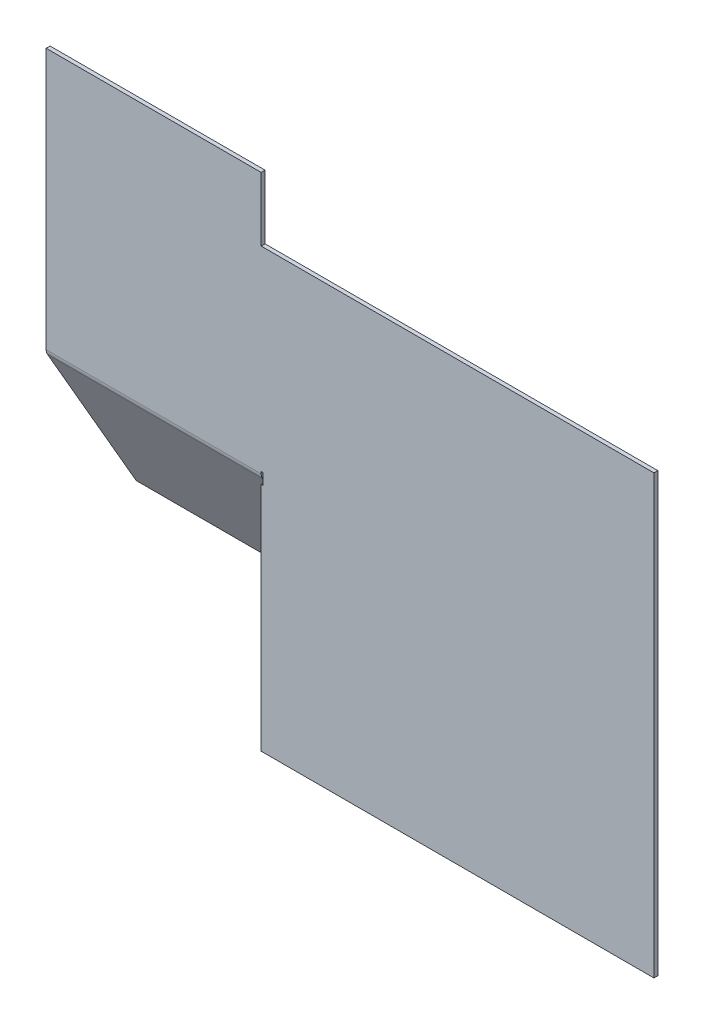
ISO-10303-21;
HEADER;
FILE_DESCRIPTION(('STEP AP214'),'2;1');
FILE_NAME('part.step','',(''),(''),'','','');
FILE_SCHEMA(('AUTOMOTIVE_DESIGN { 1 0 10303 214 1 1 1 1 }'));
ENDSEC;
DATA;
#1=APPLICATION_CONTEXT('core data for automotive mechanical design processes');
#2=APPLICATION_PROTOCOL_DEFINITION('international standard','automotive_design',2000,#1);
#3=PRODUCT_CONTEXT('',#1,'mechanical');
#4=PRODUCT('Part','Part','',(#3));
#5=PRODUCT_RELATED_PRODUCT_CATEGORY('part','',(#4));
#6=PRODUCT_DEFINITION_FORMATION('','',#4);
#7=PRODUCT_DEFINITION_CONTEXT('part definition',#1,'design');
#8=PRODUCT_DEFINITION('design','',#6,#7);
#9=PRODUCT_DEFINITION_SHAPE('','',#8);
#10=(LENGTH_UNIT() NAMED_UNIT(*) SI_UNIT(.MILLI.,.METRE.));
#11=(NAMED_UNIT(*) PLANE_ANGLE_UNIT() SI_UNIT($,.RADIAN.));
#12=(NAMED_UNIT(*) SI_UNIT($,.STERADIAN.) SOLID_ANGLE_UNIT());
#13=UNCERTAINTY_MEASURE_WITH_UNIT(LENGTH_MEASURE(1.E-05),#10,'distance_accuracy_value','');
#14=(GEOMETRIC_REPRESENTATION_CONTEXT(3) GLOBAL_UNCERTAINTY_ASSIGNED_CONTEXT((#13)) GLOBAL_UNIT_ASSIGNED_CONTEXT((#10,
#11,#12)) REPRESENTATION_CONTEXT('',''));
#15=CARTESIAN_POINT('',(0.,0.,0.));
#16=DIRECTION('',(0.,0.,1.));
#17=DIRECTION('',(1.,0.,0.));
#18=AXIS2_PLACEMENT_3D('',#15,#16,#17);
#19=CARTESIAN_POINT('',(-158.715779703997,93.9806866952789,-1.51892));
#20=DIRECTION('',(-1.,0.,0.));
#21=DIRECTION('',(0.,0.,1.));
#22=AXIS2_PLACEMENT_3D('',#19,#20,#21);
#23=PLANE('',#22);
#24=DIRECTION('',(0.,-1.,0.));
#25=VECTOR('',#24,1.);
#26=CARTESIAN_POINT('',(-158.715779703997,93.9806866952789,-1.51892));
#27=LINE('',#26,#25);
#28=CARTESIAN_POINT('',(-158.715779703997,93.9806866952789,-1.51892));
#29=VERTEX_POINT('',#28);
#30=CARTESIAN_POINT('',(-158.715779703997,-7.47103009313973,-1.51892));
#31=VERTEX_POINT('',#30);
#32=EDGE_CURVE('E169',#29,#31,#27,.T.);
#33=ORIENTED_EDGE('',*,*,#32,.T.);
#34=DIRECTION('',(0.,0.,1.));
#35=VECTOR('',#34,1.);
#36=CARTESIAN_POINT('',(-158.715779703997,-7.47103009313973,-1.51892));
#37=LINE('',#36,#35);
#38=CARTESIAN_POINT('',(-158.715779703997,-7.47103009313973,0.));
#39=VERTEX_POINT('',#38);
#40=EDGE_CURVE('E258',#31,#39,#37,.T.);
#41=ORIENTED_EDGE('',*,*,#40,.T.);
#42=DIRECTION('',(0.,-1.,0.));
#43=VECTOR('',#42,1.);
#44=CARTESIAN_POINT('',(-158.715779703997,93.9806866952789,0.));
#45=LINE('',#44,#43);
#46=CARTESIAN_POINT('',(-158.715779703997,93.9806866952789,0.));
#47=VERTEX_POINT('',#46);
#48=EDGE_CURVE('E150',#47,#39,#45,.T.);
#49=ORIENTED_EDGE('',*,*,#48,.F.);
#50=DIRECTION('',(0.,0.,1.));
#51=VECTOR('',#50,1.);
#52=CARTESIAN_POINT('',(-158.715779703997,93.9806866952789,-1.51892));
#53=LINE('',#52,#51);
#54=EDGE_CURVE('E71',#29,#47,#53,.T.);
#55=ORIENTED_EDGE('',*,*,#54,.F.);
#56=EDGE_LOOP('',(#33,#41,#49,#55));
#57=FACE_BOUND('',#56,.T.);
#58=ADVANCED_FACE('F55',(#57),#23,.T.);
#59=CARTESIAN_POINT('',(0.,0.,-1.51892));
#60=DIRECTION('',(0.,0.,1.));
#61=DIRECTION('',(1.,0.,0.));
#62=AXIS2_PLACEMENT_3D('',#59,#60,#61);
#63=PLANE('',#62);
#64=DIRECTION('',(-1.,0.,0.));
#65=VECTOR('',#64,1.);
#66=CARTESIAN_POINT('',(-158.715779703997,-7.47103009313973,-1.51892));
#67=LINE('',#66,#65);
#68=CARTESIAN_POINT('',(-75.1624597214999,-7.47103009313973,-1.51892));
#69=VERTEX_POINT('',#68);
#70=EDGE_CURVE('E263',#31,#69,#67,.F.);
#71=ORIENTED_EDGE('',*,*,#70,.F.);
#72=ORIENTED_EDGE('',*,*,#32,.F.);
#73=DIRECTION('',(-1.,0.,0.));
#74=VECTOR('',#73,1.);
#75=CARTESIAN_POINT('',(-158.715779703997,93.9806866952789,-1.51892));
#76=LINE('',#75,#74);
#77=CARTESIAN_POINT('',(-75.1624597214999,93.9806866952789,-1.51892));
#78=VERTEX_POINT('',#77);
#79=EDGE_CURVE('E138',#78,#29,#76,.T.);
#80=ORIENTED_EDGE('',*,*,#79,.F.);
#81=DIRECTION('',(0.,1.,0.));
#82=VECTOR('',#81,1.);
#83=CARTESIAN_POINT('',(-75.1624597214999,93.9806866952789,-1.51892));
#84=LINE('',#83,#82);
#85=CARTESIAN_POINT('',(-75.1624597214999,69.1855268970568,-1.51892));
#86=VERTEX_POINT('',#85);
#87=EDGE_CURVE('E123',#86,#78,#84,.T.);
#88=ORIENTED_EDGE('',*,*,#87,.F.);
#89=DIRECTION('',(-1.,0.,0.));
#90=VECTOR('',#89,1.);
#91=CARTESIAN_POINT('',(-75.1624597214999,69.1855268970568,-1.51892));
#92=LINE('',#91,#90);
#93=CARTESIAN_POINT('',(77.4785037258567,69.1855268970568,-1.51892));
#94=VERTEX_POINT('',#93);
#95=EDGE_CURVE('E137',#94,#86,#92,.T.);
#96=ORIENTED_EDGE('',*,*,#95,.F.);
#97=DIRECTION('',(0.,1.,0.));
#98=VECTOR('',#97,1.);
#99=CARTESIAN_POINT('',(77.4785037258567,-100.814473102943,-1.51892));
#100=LINE('',#99,#98);
#101=CARTESIAN_POINT('',(77.4785037258567,-100.814473102943,-1.51892));
#102=VERTEX_POINT('',#101);
#103=EDGE_CURVE('E142',#102,#94,#100,.T.);
#104=ORIENTED_EDGE('',*,*,#103,.F.);
#105=DIRECTION('',(1.,0.,0.));
#106=VECTOR('',#105,1.);
#107=CARTESIAN_POINT('',(-75.1624597214999,-100.814473102943,-1.51892));
#108=LINE('',#107,#106);
#109=CARTESIAN_POINT('',(-75.1624597214999,-100.814473102943,-1.51892));
#110=VERTEX_POINT('',#109);
#111=EDGE_CURVE('E144',#110,#102,#108,.T.);
#112=ORIENTED_EDGE('',*,*,#111,.F.);
#113=DIRECTION('',(0.,-1.,0.));
#114=VECTOR('',#113,1.);
#115=CARTESIAN_POINT('',(-75.1624597214999,-11.019313304721,-1.51892));
#116=LINE('',#115,#114);
#117=CARTESIAN_POINT('',(-75.1624597214999,-11.019313304721,-1.51892));
#118=VERTEX_POINT('',#117);
#119=EDGE_CURVE('E220',#118,#110,#116,.T.);
#120=ORIENTED_EDGE('',*,*,#119,.F.);
#121=DIRECTION('',(-1.,0.,0.));
#122=VECTOR('',#121,1.);
#123=CARTESIAN_POINT('',(-74.4029997214999,-11.019313304721,-1.51892));
#124=LINE('',#123,#122);
#125=CARTESIAN_POINT('',(-74.4029997214999,-11.019313304721,-1.51892));
#126=VERTEX_POINT('',#125);
#127=EDGE_CURVE('E238',#126,#118,#124,.T.);
#128=ORIENTED_EDGE('',*,*,#127,.F.);
#129=DIRECTION('',(0.,-1.,0.));
#130=VECTOR('',#129,1.);
#131=CARTESIAN_POINT('',(-74.4029997214999,-6.71157009313973,-1.51892));
#132=LINE('',#131,#130);
#133=CARTESIAN_POINT('',(-74.4029997214999,-6.71157009313973,-1.51892));
#134=VERTEX_POINT('',#133);
#135=EDGE_CURVE('E211',#134,#126,#132,.T.);
#136=ORIENTED_EDGE('',*,*,#135,.F.);
#137=DIRECTION('',(1.,0.,0.));
#138=VECTOR('',#137,1.);
#139=CARTESIAN_POINT('',(-75.1624597214999,-6.71157009313973,-1.51892));
#140=LINE('',#139,#138);
#141=CARTESIAN_POINT('',(-75.1624597214999,-6.71157009313973,-1.51892));
#142=VERTEX_POINT('',#141);
#143=EDGE_CURVE('E210',#142,#134,#140,.T.);
#144=ORIENTED_EDGE('',*,*,#143,.F.);
#145=DIRECTION('',(0.,1.,0.));
#146=VECTOR('',#145,1.);
#147=CARTESIAN_POINT('',(-75.1624597214999,-7.47103009313973,-1.51892));
#148=LINE('',#147,#146);
#149=EDGE_CURVE('E154',#69,#142,#148,.T.);
#150=ORIENTED_EDGE('',*,*,#149,.F.);
#151=EDGE_LOOP('',(#71,#72,#80,#88,#96,#104,#112,#120,#128,#136,#144,#150));
#152=FACE_BOUND('',#151,.T.);
#153=ADVANCED_FACE('F135',(#152),#63,.F.);
#154=CARTESIAN_POINT('',(0.,0.,0.));
#155=DIRECTION('',(0.,0.,1.));
#156=DIRECTION('',(1.,0.,0.));
#157=AXIS2_PLACEMENT_3D('',#154,#155,#156);
#158=PLANE('',#157);
#159=ORIENTED_EDGE('',*,*,#48,.T.);
#160=DIRECTION('',(-1.,0.,0.));
#161=VECTOR('',#160,1.);
#162=CARTESIAN_POINT('',(-158.715779703997,-7.47103009313973,0.));
#163=LINE('',#162,#161);
#164=CARTESIAN_POINT('',(-75.1624597214999,-7.47103009313973,0.));
#165=VERTEX_POINT('',#164);
#166=EDGE_CURVE('E266',#39,#165,#163,.F.);
#167=ORIENTED_EDGE('',*,*,#166,.T.);
#168=DIRECTION('',(0.,1.,0.));
#169=VECTOR('',#168,1.);
#170=CARTESIAN_POINT('',(-75.1624597214999,0.,0.));
#171=LINE('',#170,#169);
#172=CARTESIAN_POINT('',(-75.1624597214999,-6.71157009313973,0.));
#173=VERTEX_POINT('',#172);
#174=EDGE_CURVE('E13',#165,#173,#171,.T.);
#175=ORIENTED_EDGE('',*,*,#174,.T.);
#176=DIRECTION('',(1.,0.,0.));
#177=VECTOR('',#176,1.);
#178=CARTESIAN_POINT('',(0.,-6.71157009313973,0.));
#179=LINE('',#178,#177);
#180=CARTESIAN_POINT('',(-74.4029997214999,-6.71157009313973,0.));
#181=VERTEX_POINT('',#180);
#182=EDGE_CURVE('E63',#173,#181,#179,.T.);
#183=ORIENTED_EDGE('',*,*,#182,.T.);
#184=DIRECTION('',(0.,-1.,0.));
#185=VECTOR('',#184,1.);
#186=CARTESIAN_POINT('',(-74.4029997214999,0.,0.));
#187=LINE('',#186,#185);
#188=CARTESIAN_POINT('',(-74.4029997214999,-11.019313304721,0.));
#189=VERTEX_POINT('',#188);
#190=EDGE_CURVE('E181',#181,#189,#187,.T.);
#191=ORIENTED_EDGE('',*,*,#190,.T.);
#192=DIRECTION('',(-1.,0.,0.));
#193=VECTOR('',#192,1.);
#194=CARTESIAN_POINT('',(0.,-11.0193133047209,0.));
#195=LINE('',#194,#193);
#196=CARTESIAN_POINT('',(-75.1624597214999,-11.019313304721,0.));
#197=VERTEX_POINT('',#196);
#198=EDGE_CURVE('E171',#189,#197,#195,.T.);
#199=ORIENTED_EDGE('',*,*,#198,.T.);
#200=DIRECTION('',(0.,-1.,0.));
#201=VECTOR('',#200,1.);
#202=CARTESIAN_POINT('',(-75.1624597214999,-11.019313304721,0.));
#203=LINE('',#202,#201);
#204=CARTESIAN_POINT('',(-75.1624597214999,-100.814473102943,0.));
#205=VERTEX_POINT('',#204);
#206=EDGE_CURVE('E153',#197,#205,#203,.T.);
#207=ORIENTED_EDGE('',*,*,#206,.T.);
#208=DIRECTION('',(1.,0.,0.));
#209=VECTOR('',#208,1.);
#210=CARTESIAN_POINT('',(-75.1624597214999,-100.814473102943,0.));
#211=LINE('',#210,#209);
#212=CARTESIAN_POINT('',(77.4785037258567,-100.814473102943,0.));
#213=VERTEX_POINT('',#212);
#214=EDGE_CURVE('E157',#205,#213,#211,.T.);
#215=ORIENTED_EDGE('',*,*,#214,.T.);
#216=DIRECTION('',(0.,1.,0.));
#217=VECTOR('',#216,1.);
#218=CARTESIAN_POINT('',(77.4785037258567,69.1855268970568,0.));
#219=LINE('',#218,#217);
#220=CARTESIAN_POINT('',(77.4785037258567,69.1855268970568,0.));
#221=VERTEX_POINT('',#220);
#222=EDGE_CURVE('E160',#213,#221,#219,.T.);
#223=ORIENTED_EDGE('',*,*,#222,.T.);
#224=DIRECTION('',(-1.,0.,0.));
#225=VECTOR('',#224,1.);
#226=CARTESIAN_POINT('',(-75.1624597214999,69.1855268970568,0.));
#227=LINE('',#226,#225);
#228=CARTESIAN_POINT('',(-75.1624597214999,69.1855268970568,0.));
#229=VERTEX_POINT('',#228);
#230=EDGE_CURVE('E163',#221,#229,#227,.T.);
#231=ORIENTED_EDGE('',*,*,#230,.T.);
#232=DIRECTION('',(0.,1.,0.));
#233=VECTOR('',#232,1.);
#234=CARTESIAN_POINT('',(-75.1624597214999,93.9806866952789,0.));
#235=LINE('',#234,#233);
#236=CARTESIAN_POINT('',(-75.1624597214999,93.9806866952789,0.));
#237=VERTEX_POINT('',#236);
#238=EDGE_CURVE('E125',#229,#237,#235,.T.);
#239=ORIENTED_EDGE('',*,*,#238,.T.);
#240=DIRECTION('',(-1.,0.,0.));
#241=VECTOR('',#240,1.);
#242=CARTESIAN_POINT('',(-158.715779703997,93.9806866952789,0.));
#243=LINE('',#242,#241);
#244=EDGE_CURVE('E166',#237,#47,#243,.T.);
#245=ORIENTED_EDGE('',*,*,#244,.T.);
#246=EDGE_LOOP('',(#159,#167,#175,#183,#191,#199,#207,#215,#223,#231,#239,#245));
#247=FACE_BOUND('',#246,.T.);
#248=ADVANCED_FACE('F187',(#247),#158,.T.);
#249=CARTESIAN_POINT('',(-158.715779703997,93.9806866952789,-1.51892));
#250=DIRECTION('',(0.,1.,0.));
#251=DIRECTION('',(0.,0.,1.));
#252=AXIS2_PLACEMENT_3D('',#249,#250,#251);
#253=PLANE('',#252);
#254=ORIENTED_EDGE('',*,*,#244,.F.);
#255=DIRECTION('',(0.,0.,1.));
#256=VECTOR('',#255,1.);
#257=CARTESIAN_POINT('',(-75.1624597214999,93.9806866952789,-1.51892));
#258=LINE('',#257,#256);
#259=EDGE_CURVE('E98',#78,#237,#258,.T.);
#260=ORIENTED_EDGE('',*,*,#259,.F.);
#261=ORIENTED_EDGE('',*,*,#79,.T.);
#262=ORIENTED_EDGE('',*,*,#54,.T.);
#263=EDGE_LOOP('',(#254,#260,#261,#262));
#264=FACE_BOUND('',#263,.T.);
#265=ADVANCED_FACE('F264',(#264),#253,.T.);
#266=CARTESIAN_POINT('',(-75.1624597214999,93.9806866952789,-1.51892));
#267=DIRECTION('',(1.,0.,0.));
#268=DIRECTION('',(0.,0.,-1.));
#269=AXIS2_PLACEMENT_3D('',#266,#267,#268);
#270=PLANE('',#269);
#271=ORIENTED_EDGE('',*,*,#238,.F.);
#272=DIRECTION('',(0.,0.,1.));
#273=VECTOR('',#272,1.);
#274=CARTESIAN_POINT('',(-75.1624597214999,69.1855268970568,-1.51892));
#275=LINE('',#274,#273);
#276=EDGE_CURVE('E120',#86,#229,#275,.T.);
#277=ORIENTED_EDGE('',*,*,#276,.F.);
#278=ORIENTED_EDGE('',*,*,#87,.T.);
#279=ORIENTED_EDGE('',*,*,#259,.T.);
#280=EDGE_LOOP('',(#271,#277,#278,#279));
#281=FACE_BOUND('',#280,.T.);
#282=ADVANCED_FACE('F122',(#281),#270,.T.);
#283=CARTESIAN_POINT('',(-75.1624597214999,69.1855268970568,-1.51892));
#284=DIRECTION('',(0.,1.,0.));
#285=DIRECTION('',(0.,0.,1.));
#286=AXIS2_PLACEMENT_3D('',#283,#284,#285);
#287=PLANE('',#286);
#288=ORIENTED_EDGE('',*,*,#230,.F.);
#289=DIRECTION('',(0.,0.,1.));
#290=VECTOR('',#289,1.);
#291=CARTESIAN_POINT('',(77.4785037258567,69.1855268970568,-1.51892));
#292=LINE('',#291,#290);
#293=EDGE_CURVE('E130',#94,#221,#292,.T.);
#294=ORIENTED_EDGE('',*,*,#293,.F.);
#295=ORIENTED_EDGE('',*,*,#95,.T.);
#296=ORIENTED_EDGE('',*,*,#276,.T.);
#297=EDGE_LOOP('',(#288,#294,#295,#296));
#298=FACE_BOUND('',#297,.T.);
#299=ADVANCED_FACE('F141',(#298),#287,.T.);
#300=CARTESIAN_POINT('',(77.4785037258567,69.1855268970568,-1.51892));
#301=DIRECTION('',(1.,0.,0.));
#302=DIRECTION('',(0.,0.,-1.));
#303=AXIS2_PLACEMENT_3D('',#300,#301,#302);
#304=PLANE('',#303);
#305=ORIENTED_EDGE('',*,*,#222,.F.);
#306=DIRECTION('',(0.,0.,1.));
#307=VECTOR('',#306,1.);
#308=CARTESIAN_POINT('',(77.4785037258567,-100.814473102943,-1.51892));
#309=LINE('',#308,#307);
#310=EDGE_CURVE('E174',#102,#213,#309,.T.);
#311=ORIENTED_EDGE('',*,*,#310,.F.);
#312=ORIENTED_EDGE('',*,*,#103,.T.);
#313=ORIENTED_EDGE('',*,*,#293,.T.);
#314=EDGE_LOOP('',(#305,#311,#312,#313));
#315=FACE_BOUND('',#314,.T.);
#316=ADVANCED_FACE('F240',(#315),#304,.T.);
#317=CARTESIAN_POINT('',(-75.1624597214999,-100.814473102943,-1.51892));
#318=DIRECTION('',(0.,-1.,0.));
#319=DIRECTION('',(0.,0.,-1.));
#320=AXIS2_PLACEMENT_3D('',#317,#318,#319);
#321=PLANE('',#320);
#322=ORIENTED_EDGE('',*,*,#214,.F.);
#323=DIRECTION('',(0.,0.,1.));
#324=VECTOR('',#323,1.);
#325=CARTESIAN_POINT('',(-75.1624597214999,-100.814473102943,-1.51892));
#326=LINE('',#325,#324);
#327=EDGE_CURVE('E110',#110,#205,#326,.T.);
#328=ORIENTED_EDGE('',*,*,#327,.F.);
#329=ORIENTED_EDGE('',*,*,#111,.T.);
#330=ORIENTED_EDGE('',*,*,#310,.T.);
#331=EDGE_LOOP('',(#322,#328,#329,#330));
#332=FACE_BOUND('',#331,.T.);
#333=ADVANCED_FACE('F222',(#332),#321,.T.);
#334=CARTESIAN_POINT('',(-75.1624597214999,-11.019313304721,-1.51892));
#335=DIRECTION('',(-1.,0.,0.));
#336=DIRECTION('',(0.,-1.,0.));
#337=AXIS2_PLACEMENT_3D('',#334,#335,#336);
#338=PLANE('',#337);
#339=ORIENTED_EDGE('',*,*,#206,.F.);
#340=DIRECTION('',(0.,0.,1.));
#341=VECTOR('',#340,1.);
#342=CARTESIAN_POINT('',(-75.1624597214999,-11.019313304721,-1.51892));
#343=LINE('',#342,#341);
#344=EDGE_CURVE('E149',#118,#197,#343,.T.);
#345=ORIENTED_EDGE('',*,*,#344,.F.);
#346=ORIENTED_EDGE('',*,*,#119,.T.);
#347=ORIENTED_EDGE('',*,*,#327,.T.);
#348=EDGE_LOOP('',(#339,#345,#346,#347));
#349=FACE_BOUND('',#348,.T.);
#350=ADVANCED_FACE('F229',(#349),#338,.T.);
#351=CARTESIAN_POINT('',(-75.1624597214999,-7.47103009313973,-1.51892));
#352=DIRECTION('',(1.,0.,0.));
#353=DIRECTION('',(0.,0.,-1.));
#354=AXIS2_PLACEMENT_3D('',#351,#352,#353);
#355=PLANE('',#354);
#356=ORIENTED_EDGE('',*,*,#174,.F.);
#357=DIRECTION('',(0.,0.,1.));
#358=VECTOR('',#357,1.);
#359=CARTESIAN_POINT('',(-75.1624597214999,-7.47103009313973,-1.51892));
#360=LINE('',#359,#358);
#361=EDGE_CURVE('E290',#69,#165,#360,.T.);
#362=ORIENTED_EDGE('',*,*,#361,.F.);
#363=ORIENTED_EDGE('',*,*,#149,.T.);
#364=DIRECTION('',(0.,0.,1.));
#365=VECTOR('',#364,1.);
#366=CARTESIAN_POINT('',(-75.1624597214999,-6.71157009313973,-1.51892));
#367=LINE('',#366,#365);
#368=EDGE_CURVE('E201',#142,#173,#367,.T.);
#369=ORIENTED_EDGE('',*,*,#368,.T.);
#370=EDGE_LOOP('',(#356,#362,#363,#369));
#371=FACE_BOUND('',#370,.T.);
#372=ADVANCED_FACE('F206',(#371),#355,.T.);
#373=CARTESIAN_POINT('',(-75.1624597214999,-6.71157009313973,-1.51892));
#374=DIRECTION('',(0.,-1.,0.));
#375=DIRECTION('',(0.,0.,-1.));
#376=AXIS2_PLACEMENT_3D('',#373,#374,#375);
#377=PLANE('',#376);
#378=ORIENTED_EDGE('',*,*,#182,.F.);
#379=ORIENTED_EDGE('',*,*,#368,.F.);
#380=ORIENTED_EDGE('',*,*,#143,.T.);
#381=DIRECTION('',(0.,0.,1.));
#382=VECTOR('',#381,1.);
#383=CARTESIAN_POINT('',(-74.4029997214999,-6.71157009313973,-1.51892));
#384=LINE('',#383,#382);
#385=EDGE_CURVE('E204',#134,#181,#384,.T.);
#386=ORIENTED_EDGE('',*,*,#385,.T.);
#387=EDGE_LOOP('',(#378,#379,#380,#386));
#388=FACE_BOUND('',#387,.T.);
#389=ADVANCED_FACE('F198',(#388),#377,.T.);
#390=CARTESIAN_POINT('',(-74.4029997214999,-6.71157009313973,-1.51892));
#391=DIRECTION('',(-1.,0.,0.));
#392=DIRECTION('',(0.,0.,1.));
#393=AXIS2_PLACEMENT_3D('',#390,#391,#392);
#394=PLANE('',#393);
#395=ORIENTED_EDGE('',*,*,#190,.F.);
#396=ORIENTED_EDGE('',*,*,#385,.F.);
#397=ORIENTED_EDGE('',*,*,#135,.T.);
#398=DIRECTION('',(0.,0.,1.));
#399=VECTOR('',#398,1.);
#400=CARTESIAN_POINT('',(-74.4029997214999,-11.019313304721,-1.51892));
#401=LINE('',#400,#399);
#402=EDGE_CURVE('E288',#126,#189,#401,.T.);
#403=ORIENTED_EDGE('',*,*,#402,.T.);
#404=EDGE_LOOP('',(#395,#396,#397,#403));
#405=FACE_BOUND('',#404,.T.);
#406=ADVANCED_FACE('F292',(#405),#394,.T.);
#407=CARTESIAN_POINT('',(-74.4029997214999,-11.019313304721,-1.51892));
#408=DIRECTION('',(0.,1.,0.));
#409=DIRECTION('',(-1.,0.,0.));
#410=AXIS2_PLACEMENT_3D('',#407,#408,#409);
#411=PLANE('',#410);
#412=ORIENTED_EDGE('',*,*,#198,.F.);
#413=ORIENTED_EDGE('',*,*,#402,.F.);
#414=ORIENTED_EDGE('',*,*,#127,.T.);
#415=ORIENTED_EDGE('',*,*,#344,.T.);
#416=EDGE_LOOP('',(#412,#413,#414,#415));
#417=FACE_BOUND('',#416,.T.);
#418=ADVANCED_FACE('F235',(#417),#411,.T.);
#419=CARTESIAN_POINT('',(-75.1624597214999,-7.47103009313973,-3.42392));
#420=DIRECTION('',(1.,0.,0.));
#421=DIRECTION('',(0.,0.,-1.));
#422=AXIS2_PLACEMENT_3D('',#419,#420,#421);
#423=PLANE('',#422);
#424=DIRECTION('',(0.,-0.499999999999995,0.866025403784442));
#425=VECTOR('',#424,1.);
#426=CARTESIAN_POINT('',(-75.1624597214999,-9.18299009313971,-0.458718299474373));
#427=LINE('',#426,#425);
#428=CARTESIAN_POINT('',(-75.1624597214999,-8.42353009313972,-1.77414160579064));
#429=VERTEX_POINT('',#428);
#430=CARTESIAN_POINT('',(-75.1624597214999,-9.18299009313972,-0.458718299474374));
#431=VERTEX_POINT('',#430);
#432=EDGE_CURVE('E313',#429,#431,#427,.T.);
#433=ORIENTED_EDGE('',*,*,#432,.F.);
#434=CARTESIAN_POINT('',(-75.1624597214999,-7.47103009313973,-3.42392));
#435=DIRECTION('',(-1.,0.,0.));
#436=DIRECTION('',(0.,0.,1.));
#437=AXIS2_PLACEMENT_3D('',#434,#435,#436);
#438=CIRCLE('',#437,1.905);
#439=EDGE_CURVE('E305',#69,#429,#438,.F.);
#440=ORIENTED_EDGE('',*,*,#439,.F.);
#441=ORIENTED_EDGE('',*,*,#361,.T.);
#442=CARTESIAN_POINT('',(-75.1624597214999,-7.47103009313973,-3.42392));
#443=DIRECTION('',(-1.,0.,0.));
#444=DIRECTION('',(0.,0.,1.));
#445=AXIS2_PLACEMENT_3D('',#442,#443,#444);
#446=CIRCLE('',#445,3.42392);
#447=EDGE_CURVE('E297',#165,#431,#446,.F.);
#448=ORIENTED_EDGE('',*,*,#447,.T.);
#449=EDGE_LOOP('',(#433,#440,#441,#448));
#450=FACE_BOUND('',#449,.T.);
#451=ADVANCED_FACE('F375',(#450),#423,.T.);
#452=CARTESIAN_POINT('',(-158.715779703997,-7.47103009313973,-3.42392));
#453=DIRECTION('',(1.,0.,0.));
#454=DIRECTION('',(0.,0.,-1.));
#455=AXIS2_PLACEMENT_3D('',#452,#453,#454);
#456=PLANE('',#455);
#457=CARTESIAN_POINT('',(-158.715779703997,-7.47103009313973,-3.42392));
#458=DIRECTION('',(-1.,0.,0.));
#459=DIRECTION('',(0.,0.,1.));
#460=AXIS2_PLACEMENT_3D('',#457,#458,#459);
#461=CIRCLE('',#460,1.905);
#462=CARTESIAN_POINT('',(-158.715779703997,-8.42353009313972,-1.77414160579064));
#463=VERTEX_POINT('',#462);
#464=EDGE_CURVE('E300',#463,#31,#461,.T.);
#465=ORIENTED_EDGE('',*,*,#464,.F.);
#466=DIRECTION('',(0.,-0.499999999999995,0.866025403784442));
#467=VECTOR('',#466,1.);
#468=CARTESIAN_POINT('',(-158.715779703997,-8.42353009313972,-1.77414160579064));
#469=LINE('',#468,#467);
#470=CARTESIAN_POINT('',(-158.715779703997,-9.18299009313972,-0.458718299474374));
#471=VERTEX_POINT('',#470);
#472=EDGE_CURVE('E318',#463,#471,#469,.T.);
#473=ORIENTED_EDGE('',*,*,#472,.T.);
#474=CARTESIAN_POINT('',(-158.715779703997,-7.47103009313973,-3.42392));
#475=DIRECTION('',(-1.,0.,0.));
#476=DIRECTION('',(0.,0.,1.));
#477=AXIS2_PLACEMENT_3D('',#474,#475,#476);
#478=CIRCLE('',#477,3.42392);
#479=EDGE_CURVE('E308',#471,#39,#478,.T.);
#480=ORIENTED_EDGE('',*,*,#479,.T.);
#481=ORIENTED_EDGE('',*,*,#40,.F.);
#482=EDGE_LOOP('',(#465,#473,#480,#481));
#483=FACE_BOUND('',#482,.T.);
#484=ADVANCED_FACE('F368',(#483),#456,.F.);
#485=CARTESIAN_POINT('',(-158.715779703997,-7.47103009313973,-3.42392));
#486=DIRECTION('',(-1.,0.,0.));
#487=DIRECTION('',(0.,-0.499999999999995,0.866025403784442));
#488=AXIS2_PLACEMENT_3D('',#485,#486,#487);
#489=CYLINDRICAL_SURFACE('',#488,3.42392);
#490=ORIENTED_EDGE('',*,*,#166,.F.);
#491=ORIENTED_EDGE('',*,*,#479,.F.);
#492=DIRECTION('',(-1.,0.,0.));
#493=VECTOR('',#492,1.);
#494=CARTESIAN_POINT('',(0.,-9.18299009313972,-0.458718299474374));
#495=LINE('',#494,#493);
#496=EDGE_CURVE('E321',#431,#471,#495,.T.);
#497=ORIENTED_EDGE('',*,*,#496,.F.);
#498=ORIENTED_EDGE('',*,*,#447,.F.);
#499=EDGE_LOOP('',(#490,#491,#497,#498));
#500=FACE_BOUND('',#499,.T.);
#501=ADVANCED_FACE('F373',(#500),#489,.T.);
#502=CARTESIAN_POINT('',(-158.715779703997,-7.47103009313973,-3.42392));
#503=DIRECTION('',(-1.,0.,0.));
#504=DIRECTION('',(0.,-0.499999999999995,0.866025403784442));
#505=AXIS2_PLACEMENT_3D('',#502,#503,#504);
#506=CYLINDRICAL_SURFACE('',#505,1.905);
#507=ORIENTED_EDGE('',*,*,#70,.T.);
#508=ORIENTED_EDGE('',*,*,#439,.T.);
#509=DIRECTION('',(1.,0.,0.));
#510=VECTOR('',#509,1.);
#511=CARTESIAN_POINT('',(-75.1624597214999,-8.42353009313972,-1.77414160579064));
#512=LINE('',#511,#510);
#513=EDGE_CURVE('E316',#429,#463,#512,.F.);
#514=ORIENTED_EDGE('',*,*,#513,.T.);
#515=ORIENTED_EDGE('',*,*,#464,.T.);
#516=EDGE_LOOP('',(#507,#508,#514,#515));
#517=FACE_BOUND('',#516,.T.);
#518=ADVANCED_FACE('F388',(#517),#506,.F.);
#519=CARTESIAN_POINT('',(-158.715779703997,-8.74093330472101,-0.203496693683736));
#520=DIRECTION('',(-1.,0.,0.));
#521=DIRECTION('',(0.,0.,1.));
#522=AXIS2_PLACEMENT_3D('',#519,#520,#521);
#523=PLANE('',#522);
#524=DIRECTION('',(0.,0.866025403784442,0.499999999999995));
#525=VECTOR('',#524,1.);
#526=CARTESIAN_POINT('',(-158.715779703997,-8.74093330472101,-0.203496693683735));
#527=LINE('',#526,#525);
#528=CARTESIAN_POINT('',(-158.715779703997,-69.0102449569994,-34.9999999999996));
#529=VERTEX_POINT('',#528);
#530=EDGE_CURVE('E339',#529,#471,#527,.T.);
#531=ORIENTED_EDGE('',*,*,#530,.T.);
#532=ORIENTED_EDGE('',*,*,#472,.F.);
#533=DIRECTION('',(0.,-0.866025403784442,-0.499999999999995));
#534=VECTOR('',#533,1.);
#535=CARTESIAN_POINT('',(-158.715779703997,0.94072332697795,3.6323126270741));
#536=LINE('',#535,#534);
#537=CARTESIAN_POINT('',(-158.715779703997,-68.2507849569994,-36.3154233063159));
#538=VERTEX_POINT('',#537);
#539=EDGE_CURVE('E330',#538,#463,#536,.F.);
#540=ORIENTED_EDGE('',*,*,#539,.F.);
#541=DIRECTION('',(0.,0.499999999999995,-0.866025403784442));
#542=VECTOR('',#541,1.);
#543=CARTESIAN_POINT('',(-158.715779703997,-69.0102449569994,-34.9999999999996));
#544=LINE('',#543,#542);
#545=EDGE_CURVE('E303',#529,#538,#544,.T.);
#546=ORIENTED_EDGE('',*,*,#545,.F.);
#547=EDGE_LOOP('',(#531,#532,#540,#546));
#548=FACE_BOUND('',#547,.T.);
#549=ADVANCED_FACE('F365',(#548),#523,.T.);
#550=CARTESIAN_POINT('',(-75.1624597214999,-69.0102449569994,-34.9999999999996));
#551=DIRECTION('',(1.,0.,0.));
#552=DIRECTION('',(0.,1.,0.));
#553=AXIS2_PLACEMENT_3D('',#550,#551,#552);
#554=PLANE('',#553);
#555=DIRECTION('',(0.,0.866025403784442,0.499999999999995));
#556=VECTOR('',#555,1.);
#557=CARTESIAN_POINT('',(-75.1624597214999,0.940723326977963,3.63231262707411));
#558=LINE('',#557,#556);
#559=CARTESIAN_POINT('',(-75.1624597214999,-68.2507849569994,-36.3154233063159));
#560=VERTEX_POINT('',#559);
#561=EDGE_CURVE('E324',#429,#560,#558,.F.);
#562=ORIENTED_EDGE('',*,*,#561,.F.);
#563=ORIENTED_EDGE('',*,*,#432,.T.);
#564=DIRECTION('',(0.,-0.866025403784442,-0.499999999999995));
#565=VECTOR('',#564,1.);
#566=CARTESIAN_POINT('',(-75.1624597214999,-69.0102449569994,-34.9999999999996));
#567=LINE('',#566,#565);
#568=CARTESIAN_POINT('',(-75.1624597214999,-69.0102449569994,-34.9999999999996));
#569=VERTEX_POINT('',#568);
#570=EDGE_CURVE('E333',#431,#569,#567,.T.);
#571=ORIENTED_EDGE('',*,*,#570,.T.);
#572=DIRECTION('',(0.,0.499999999999995,-0.866025403784442));
#573=VECTOR('',#572,1.);
#574=CARTESIAN_POINT('',(-75.1624597214999,-69.0102449569994,-34.9999999999996));
#575=LINE('',#574,#573);
#576=EDGE_CURVE('E342',#569,#560,#575,.T.);
#577=ORIENTED_EDGE('',*,*,#576,.T.);
#578=EDGE_LOOP('',(#562,#563,#571,#577));
#579=FACE_BOUND('',#578,.T.);
#580=ADVANCED_FACE('F378',(#579),#554,.T.);
#581=CARTESIAN_POINT('',(0.,0.181263326977958,4.94773593339036));
#582=DIRECTION('',(0.,-0.499999999999995,0.866025403784442));
#583=DIRECTION('',(0.,-0.866025403784442,-0.499999999999995));
#584=AXIS2_PLACEMENT_3D('',#581,#582,#583);
#585=PLANE('',#584);
#586=ORIENTED_EDGE('',*,*,#570,.F.);
#587=ORIENTED_EDGE('',*,*,#496,.T.);
#588=ORIENTED_EDGE('',*,*,#530,.F.);
#589=DIRECTION('',(-1.,0.,0.));
#590=VECTOR('',#589,1.);
#591=CARTESIAN_POINT('',(-158.715779703997,-69.0102449569994,-34.9999999999996));
#592=LINE('',#591,#590);
#593=EDGE_CURVE('E336',#569,#529,#592,.T.);
#594=ORIENTED_EDGE('',*,*,#593,.F.);
#595=EDGE_LOOP('',(#586,#587,#588,#594));
#596=FACE_BOUND('',#595,.T.);
#597=ADVANCED_FACE('F372',(#596),#585,.T.);
#598=CARTESIAN_POINT('',(0.,0.94072332697795,3.6323126270741));
#599=DIRECTION('',(0.,-0.499999999999995,0.866025403784442));
#600=DIRECTION('',(0.,-0.866025403784442,-0.499999999999995));
#601=AXIS2_PLACEMENT_3D('',#598,#599,#600);
#602=PLANE('',#601);
#603=ORIENTED_EDGE('',*,*,#513,.F.);
#604=ORIENTED_EDGE('',*,*,#561,.T.);
#605=DIRECTION('',(1.,0.,0.));
#606=VECTOR('',#605,1.);
#607=CARTESIAN_POINT('',(0.,-68.2507849569994,-36.3154233063159));
#608=LINE('',#607,#606);
#609=EDGE_CURVE('E327',#560,#538,#608,.F.);
#610=ORIENTED_EDGE('',*,*,#609,.T.);
#611=ORIENTED_EDGE('',*,*,#539,.T.);
#612=EDGE_LOOP('',(#603,#604,#610,#611));
#613=FACE_BOUND('',#612,.T.);
#614=ADVANCED_FACE('F362',(#613),#602,.F.);
#615=CARTESIAN_POINT('',(-158.715779703997,-69.0102449569994,-34.9999999999996));
#616=DIRECTION('',(0.,-0.866025403784442,-0.499999999999995));
#617=DIRECTION('',(0.,0.499999999999995,-0.866025403784442));
#618=AXIS2_PLACEMENT_3D('',#615,#616,#617);
#619=PLANE('',#618);
#620=ORIENTED_EDGE('',*,*,#609,.F.);
#621=ORIENTED_EDGE('',*,*,#576,.F.);
#622=ORIENTED_EDGE('',*,*,#593,.T.);
#623=ORIENTED_EDGE('',*,*,#545,.T.);
#624=EDGE_LOOP('',(#620,#621,#622,#623));
#625=FACE_BOUND('',#624,.T.);
#626=ADVANCED_FACE('F350',(#625),#619,.T.);
#627=CLOSED_SHELL('',(#58,#153,#248,#265,#282,#299,#316,#333,#350,#372,#389,#406,#418,#451,#484,
#501,#518,#549,#580,#597,#614,#626));
#628=MANIFOLD_SOLID_BREP('B2',#627);
#629=ADVANCED_BREP_SHAPE_REPRESENTATION('',(#18,#628),#14);
#630=SHAPE_DEFINITION_REPRESENTATION(#9,#629);
ENDSEC;
END-ISO-10303-21;
